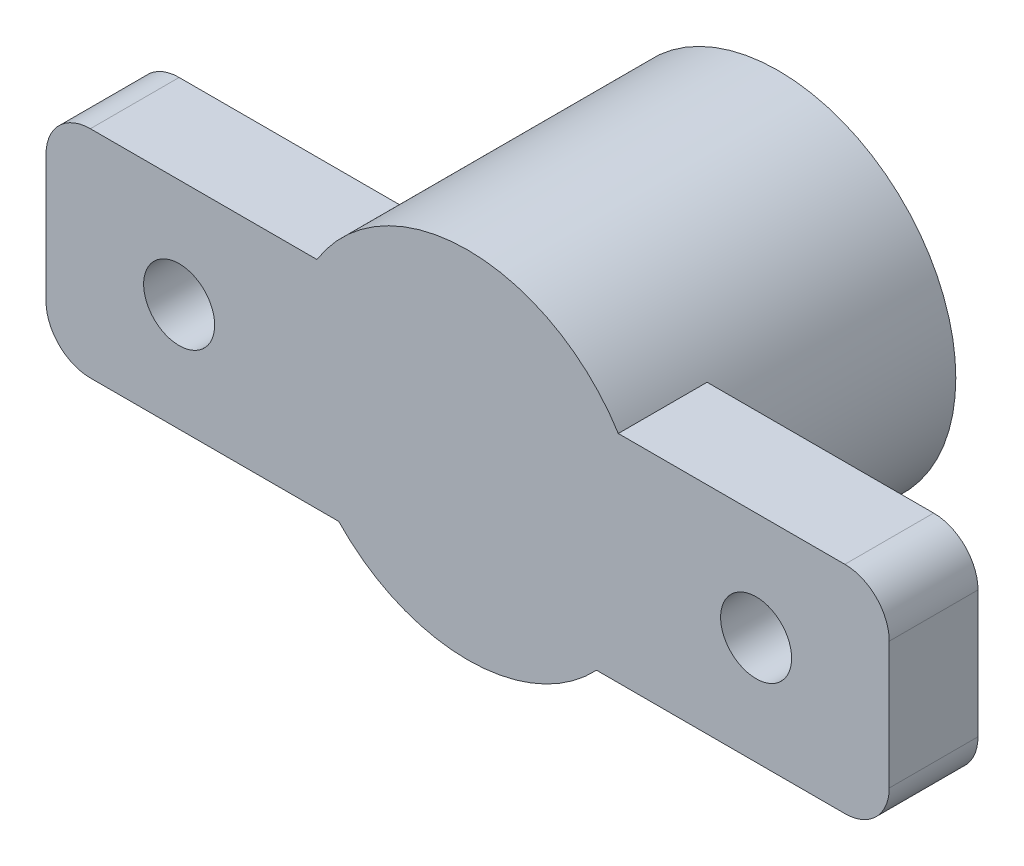
ISO-10303-21;
HEADER;
FILE_DESCRIPTION(('STEP AP214'),'2;1');
FILE_NAME('part.step','',(''),(''),'','','');
FILE_SCHEMA(('AUTOMOTIVE_DESIGN { 1 0 10303 214 1 1 1 1 }'));
ENDSEC;
DATA;
#1=APPLICATION_CONTEXT('core data for automotive mechanical design processes');
#2=APPLICATION_PROTOCOL_DEFINITION('international standard','automotive_design',2000,#1);
#3=PRODUCT_CONTEXT('',#1,'mechanical');
#4=PRODUCT('Part','Part','',(#3));
#5=PRODUCT_RELATED_PRODUCT_CATEGORY('part','',(#4));
#6=PRODUCT_DEFINITION_FORMATION('','',#4);
#7=PRODUCT_DEFINITION_CONTEXT('part definition',#1,'design');
#8=PRODUCT_DEFINITION('design','',#6,#7);
#9=PRODUCT_DEFINITION_SHAPE('','',#8);
#10=(LENGTH_UNIT() NAMED_UNIT(*) SI_UNIT(.MILLI.,.METRE.));
#11=(NAMED_UNIT(*) PLANE_ANGLE_UNIT() SI_UNIT($,.RADIAN.));
#12=(NAMED_UNIT(*) SI_UNIT($,.STERADIAN.) SOLID_ANGLE_UNIT());
#13=UNCERTAINTY_MEASURE_WITH_UNIT(LENGTH_MEASURE(1.E-05),#10,'distance_accuracy_value','');
#14=(GEOMETRIC_REPRESENTATION_CONTEXT(3) GLOBAL_UNCERTAINTY_ASSIGNED_CONTEXT((#13)) GLOBAL_UNIT_ASSIGNED_CONTEXT((#10,
#11,#12)) REPRESENTATION_CONTEXT('',''));
#15=CARTESIAN_POINT('',(0.,0.,0.));
#16=DIRECTION('',(0.,0.,1.));
#17=DIRECTION('',(1.,0.,0.));
#18=AXIS2_PLACEMENT_3D('',#15,#16,#17);
#19=CARTESIAN_POINT('',(0.,0.,0.));
#20=DIRECTION('',(0.,0.,1.));
#21=DIRECTION('',(1.,0.,0.));
#22=AXIS2_PLACEMENT_3D('',#19,#20,#21);
#23=PLANE('',#22);
#24=CARTESIAN_POINT('',(0.,0.,0.));
#25=DIRECTION('',(0.,0.,1.));
#26=DIRECTION('',(1.,0.,0.));
#27=AXIS2_PLACEMENT_3D('',#24,#25,#26);
#28=CIRCLE('',#27,8.);
#29=CARTESIAN_POINT('',(8.,0.,0.));
#30=VERTEX_POINT('',#29);
#31=EDGE_CURVE('E213',#30,#30,#28,.T.);
#32=ORIENTED_EDGE('',*,*,#31,.F.);
#33=EDGE_LOOP('',(#32));
#34=FACE_BOUND('',#33,.T.);
#35=CARTESIAN_POINT('',(0.,0.,0.));
#36=DIRECTION('',(0.,0.,1.));
#37=DIRECTION('',(1.,0.,0.));
#38=AXIS2_PLACEMENT_3D('',#35,#36,#37);
#39=CIRCLE('',#38,2.6);
#40=CARTESIAN_POINT('',(-1.6,-2.04939015319192,0.));
#41=VERTEX_POINT('',#40);
#42=CARTESIAN_POINT('',(-1.6,2.04939015319192,0.));
#43=VERTEX_POINT('',#42);
#44=EDGE_CURVE('E154',#41,#43,#39,.T.);
#45=ORIENTED_EDGE('',*,*,#44,.T.);
#46=DIRECTION('',(0.,-1.,0.));
#47=VECTOR('',#46,1.);
#48=CARTESIAN_POINT('',(-1.6,2.04939015319192,0.));
#49=LINE('',#48,#47);
#50=EDGE_CURVE('E200',#43,#41,#49,.T.);
#51=ORIENTED_EDGE('',*,*,#50,.T.);
#52=EDGE_LOOP('',(#45,#51));
#53=FACE_BOUND('',#52,.T.);
#54=ADVANCED_FACE('F33',(#34,#53),#23,.F.);
#55=CARTESIAN_POINT('',(0.,0.,10.));
#56=DIRECTION('',(0.,0.,-1.));
#57=DIRECTION('',(-1.,0.,0.));
#58=AXIS2_PLACEMENT_3D('',#55,#56,#57);
#59=CYLINDRICAL_SURFACE('',#58,8.);
#60=CARTESIAN_POINT('',(0.,0.,10.));
#61=DIRECTION('',(0.,0.,1.));
#62=DIRECTION('',(1.,0.,0.));
#63=AXIS2_PLACEMENT_3D('',#60,#61,#62);
#64=CIRCLE('',#63,8.);
#65=CARTESIAN_POINT('',(-6.79022090951392,4.23,10.));
#66=VERTEX_POINT('',#65);
#67=CARTESIAN_POINT('',(-5.80947501931113,-5.5,10.));
#68=VERTEX_POINT('',#67);
#69=EDGE_CURVE('E217',#66,#68,#64,.T.);
#70=ORIENTED_EDGE('',*,*,#69,.F.);
#71=DIRECTION('',(0.,0.,-1.));
#72=VECTOR('',#71,1.);
#73=CARTESIAN_POINT('',(-6.79022090951392,4.23,14.));
#74=LINE('',#73,#72);
#75=CARTESIAN_POINT('',(-6.79022090951392,4.23,14.));
#76=VERTEX_POINT('',#75);
#77=EDGE_CURVE('E175',#76,#66,#74,.T.);
#78=ORIENTED_EDGE('',*,*,#77,.F.);
#79=CARTESIAN_POINT('',(0.,0.,14.));
#80=DIRECTION('',(0.,0.,1.));
#81=DIRECTION('',(1.,0.,0.));
#82=AXIS2_PLACEMENT_3D('',#79,#80,#81);
#83=CIRCLE('',#82,8.);
#84=CARTESIAN_POINT('',(6.79022090951392,4.23,14.));
#85=VERTEX_POINT('',#84);
#86=EDGE_CURVE('E170',#85,#76,#83,.T.);
#87=ORIENTED_EDGE('',*,*,#86,.F.);
#88=DIRECTION('',(0.,0.,-1.));
#89=VECTOR('',#88,1.);
#90=CARTESIAN_POINT('',(6.79022090951392,4.23,14.));
#91=LINE('',#90,#89);
#92=CARTESIAN_POINT('',(6.79022090951392,4.23,10.));
#93=VERTEX_POINT('',#92);
#94=EDGE_CURVE('E192',#85,#93,#91,.T.);
#95=ORIENTED_EDGE('',*,*,#94,.T.);
#96=CARTESIAN_POINT('',(5.80947501931113,-5.5,10.));
#97=VERTEX_POINT('',#96);
#98=EDGE_CURVE('E214',#97,#93,#64,.T.);
#99=ORIENTED_EDGE('',*,*,#98,.F.);
#100=DIRECTION('',(0.,0.,-1.));
#101=VECTOR('',#100,1.);
#102=CARTESIAN_POINT('',(5.80947501931113,-5.5,14.));
#103=LINE('',#102,#101);
#104=CARTESIAN_POINT('',(5.80947501931113,-5.5,14.));
#105=VERTEX_POINT('',#104);
#106=EDGE_CURVE('E155',#105,#97,#103,.T.);
#107=ORIENTED_EDGE('',*,*,#106,.F.);
#108=CARTESIAN_POINT('',(0.,0.,14.));
#109=DIRECTION('',(0.,0.,1.));
#110=DIRECTION('',(1.,0.,0.));
#111=AXIS2_PLACEMENT_3D('',#108,#109,#110);
#112=CIRCLE('',#111,8.);
#113=CARTESIAN_POINT('',(-5.80947501931113,-5.5,14.));
#114=VERTEX_POINT('',#113);
#115=EDGE_CURVE('E138',#114,#105,#112,.T.);
#116=ORIENTED_EDGE('',*,*,#115,.F.);
#117=DIRECTION('',(0.,0.,-1.));
#118=VECTOR('',#117,1.);
#119=CARTESIAN_POINT('',(-5.80947501931113,-5.5,14.));
#120=LINE('',#119,#118);
#121=EDGE_CURVE('E148',#114,#68,#120,.T.);
#122=ORIENTED_EDGE('',*,*,#121,.T.);
#123=EDGE_LOOP('',(#70,#78,#87,#95,#99,#107,#116,#122));
#124=FACE_BOUND('',#123,.T.);
#125=ORIENTED_EDGE('',*,*,#31,.T.);
#126=EDGE_LOOP('',(#125));
#127=FACE_BOUND('',#126,.T.);
#128=ADVANCED_FACE('F157',(#124,#127),#59,.T.);
#129=CARTESIAN_POINT('',(0.,0.,10.));
#130=DIRECTION('',(0.,0.,-1.));
#131=DIRECTION('',(-1.,0.,0.));
#132=AXIS2_PLACEMENT_3D('',#129,#130,#131);
#133=CYLINDRICAL_SURFACE('',#132,2.6);
#134=ORIENTED_EDGE('',*,*,#44,.F.);
#135=DIRECTION('',(0.,0.,-1.));
#136=VECTOR('',#135,1.);
#137=CARTESIAN_POINT('',(-1.6,-2.04939015319192,10.));
#138=LINE('',#137,#136);
#139=CARTESIAN_POINT('',(-1.6,-2.04939015319192,10.));
#140=VERTEX_POINT('',#139);
#141=EDGE_CURVE('E203',#140,#41,#138,.T.);
#142=ORIENTED_EDGE('',*,*,#141,.F.);
#143=CARTESIAN_POINT('',(0.,0.,10.));
#144=DIRECTION('',(0.,0.,1.));
#145=DIRECTION('',(1.,0.,0.));
#146=AXIS2_PLACEMENT_3D('',#143,#144,#145);
#147=CIRCLE('',#146,2.6);
#148=CARTESIAN_POINT('',(-1.6,2.04939015319192,10.));
#149=VERTEX_POINT('',#148);
#150=EDGE_CURVE('E196',#140,#149,#147,.T.);
#151=ORIENTED_EDGE('',*,*,#150,.T.);
#152=DIRECTION('',(0.,0.,-1.));
#153=VECTOR('',#152,1.);
#154=CARTESIAN_POINT('',(-1.6,2.04939015319192,10.));
#155=LINE('',#154,#153);
#156=EDGE_CURVE('E210',#149,#43,#155,.T.);
#157=ORIENTED_EDGE('',*,*,#156,.T.);
#158=EDGE_LOOP('',(#134,#142,#151,#157));
#159=FACE_BOUND('',#158,.T.);
#160=ADVANCED_FACE('F275',(#159),#133,.F.);
#161=CARTESIAN_POINT('',(-1.6,2.04939015319192,10.));
#162=DIRECTION('',(1.,0.,0.));
#163=DIRECTION('',(0.,0.,-1.));
#164=AXIS2_PLACEMENT_3D('',#161,#162,#163);
#165=PLANE('',#164);
#166=ORIENTED_EDGE('',*,*,#50,.F.);
#167=ORIENTED_EDGE('',*,*,#156,.F.);
#168=DIRECTION('',(0.,-1.,0.));
#169=VECTOR('',#168,1.);
#170=CARTESIAN_POINT('',(-1.6,2.04939015319192,10.));
#171=LINE('',#170,#169);
#172=EDGE_CURVE('E199',#149,#140,#171,.T.);
#173=ORIENTED_EDGE('',*,*,#172,.T.);
#174=ORIENTED_EDGE('',*,*,#141,.T.);
#175=EDGE_LOOP('',(#166,#167,#173,#174));
#176=FACE_BOUND('',#175,.T.);
#177=ADVANCED_FACE('F282',(#176),#165,.T.);
#178=CARTESIAN_POINT('',(0.,0.,10.));
#179=DIRECTION('',(0.,0.,1.));
#180=DIRECTION('',(1.,0.,0.));
#181=AXIS2_PLACEMENT_3D('',#178,#179,#180);
#182=PLANE('',#181);
#183=ORIENTED_EDGE('',*,*,#172,.F.);
#184=ORIENTED_EDGE('',*,*,#150,.F.);
#185=EDGE_LOOP('',(#183,#184));
#186=FACE_BOUND('',#185,.T.);
#187=ADVANCED_FACE('F286',(#186),#182,.F.);
#188=CARTESIAN_POINT('',(-13.,-0.634999999999999,10.));
#189=DIRECTION('',(0.,0.,1.));
#190=DIRECTION('',(1.,0.,0.));
#191=AXIS2_PLACEMENT_3D('',#188,#189,#190);
#192=CIRCLE('',#191,1.6);
#193=CARTESIAN_POINT('',(-11.4,-0.634999999999999,10.));
#194=VERTEX_POINT('',#193);
#195=EDGE_CURVE('E178',#194,#194,#192,.T.);
#196=ORIENTED_EDGE('',*,*,#195,.T.);
#197=EDGE_LOOP('',(#196));
#198=FACE_BOUND('',#197,.T.);
#199=DIRECTION('',(0.,-1.,0.));
#200=VECTOR('',#199,1.);
#201=CARTESIAN_POINT('',(-19.,-5.5,10.));
#202=LINE('',#201,#200);
#203=CARTESIAN_POINT('',(-19.,2.23,10.));
#204=VERTEX_POINT('',#203);
#205=CARTESIAN_POINT('',(-19.,-3.5,10.));
#206=VERTEX_POINT('',#205);
#207=EDGE_CURVE('E176',#204,#206,#202,.T.);
#208=ORIENTED_EDGE('',*,*,#207,.F.);
#209=CARTESIAN_POINT('',(-17.,2.23,10.));
#210=DIRECTION('',(0.,0.,1.));
#211=DIRECTION('',(1.,0.,0.));
#212=AXIS2_PLACEMENT_3D('',#209,#210,#211);
#213=CIRCLE('',#212,2.);
#214=CARTESIAN_POINT('',(-17.,4.23,10.));
#215=VERTEX_POINT('',#214);
#216=EDGE_CURVE('E41',#204,#215,#213,.F.);
#217=ORIENTED_EDGE('',*,*,#216,.T.);
#218=DIRECTION('',(-1.,0.,0.));
#219=VECTOR('',#218,1.);
#220=CARTESIAN_POINT('',(-19.,4.23,10.));
#221=LINE('',#220,#219);
#222=EDGE_CURVE('E188',#66,#215,#221,.T.);
#223=ORIENTED_EDGE('',*,*,#222,.F.);
#224=ORIENTED_EDGE('',*,*,#69,.T.);
#225=DIRECTION('',(1.,0.,0.));
#226=VECTOR('',#225,1.);
#227=CARTESIAN_POINT('',(-5.80947501931113,-5.5,10.));
#228=LINE('',#227,#226);
#229=CARTESIAN_POINT('',(-17.,-5.5,10.));
#230=VERTEX_POINT('',#229);
#231=EDGE_CURVE('E151',#230,#68,#228,.T.);
#232=ORIENTED_EDGE('',*,*,#231,.F.);
#233=CARTESIAN_POINT('',(-17.,-3.5,10.));
#234=DIRECTION('',(0.,0.,1.));
#235=DIRECTION('',(1.,0.,0.));
#236=AXIS2_PLACEMENT_3D('',#233,#234,#235);
#237=CIRCLE('',#236,2.);
#238=EDGE_CURVE('E232',#230,#206,#237,.F.);
#239=ORIENTED_EDGE('',*,*,#238,.T.);
#240=EDGE_LOOP('',(#208,#217,#223,#224,#232,#239));
#241=FACE_BOUND('',#240,.T.);
#242=ADVANCED_FACE('F254',(#198,#241),#182,.F.);
#243=CARTESIAN_POINT('',(13.,-0.634999999999999,10.));
#244=DIRECTION('',(0.,0.,1.));
#245=DIRECTION('',(1.,0.,0.));
#246=AXIS2_PLACEMENT_3D('',#243,#244,#245);
#247=CIRCLE('',#246,1.6);
#248=CARTESIAN_POINT('',(14.6,-0.634999999999999,10.));
#249=VERTEX_POINT('',#248);
#250=EDGE_CURVE('E330',#249,#249,#247,.T.);
#251=ORIENTED_EDGE('',*,*,#250,.T.);
#252=EDGE_LOOP('',(#251));
#253=FACE_BOUND('',#252,.T.);
#254=DIRECTION('',(-1.,0.,0.));
#255=VECTOR('',#254,1.);
#256=CARTESIAN_POINT('',(6.79022090951392,4.23,10.));
#257=LINE('',#256,#255);
#258=CARTESIAN_POINT('',(17.,4.23,10.));
#259=VERTEX_POINT('',#258);
#260=EDGE_CURVE('E186',#259,#93,#257,.T.);
#261=ORIENTED_EDGE('',*,*,#260,.F.);
#262=CARTESIAN_POINT('',(17.,2.23,10.));
#263=DIRECTION('',(0.,0.,1.));
#264=DIRECTION('',(1.,0.,0.));
#265=AXIS2_PLACEMENT_3D('',#262,#263,#264);
#266=CIRCLE('',#265,2.);
#267=CARTESIAN_POINT('',(19.,2.23,10.));
#268=VERTEX_POINT('',#267);
#269=EDGE_CURVE('E241',#259,#268,#266,.F.);
#270=ORIENTED_EDGE('',*,*,#269,.T.);
#271=DIRECTION('',(0.,1.,0.));
#272=VECTOR('',#271,1.);
#273=CARTESIAN_POINT('',(19.,-5.5,10.));
#274=LINE('',#273,#272);
#275=CARTESIAN_POINT('',(19.,-3.5,10.));
#276=VERTEX_POINT('',#275);
#277=EDGE_CURVE('E183',#276,#268,#274,.T.);
#278=ORIENTED_EDGE('',*,*,#277,.F.);
#279=CARTESIAN_POINT('',(17.,-3.5,10.));
#280=DIRECTION('',(0.,0.,1.));
#281=DIRECTION('',(1.,0.,0.));
#282=AXIS2_PLACEMENT_3D('',#279,#280,#281);
#283=CIRCLE('',#282,2.);
#284=CARTESIAN_POINT('',(17.,-5.5,10.));
#285=VERTEX_POINT('',#284);
#286=EDGE_CURVE('E223',#276,#285,#283,.F.);
#287=ORIENTED_EDGE('',*,*,#286,.T.);
#288=DIRECTION('',(1.,0.,0.));
#289=VECTOR('',#288,1.);
#290=CARTESIAN_POINT('',(19.,-5.5,10.));
#291=LINE('',#290,#289);
#292=EDGE_CURVE('E180',#97,#285,#291,.T.);
#293=ORIENTED_EDGE('',*,*,#292,.F.);
#294=ORIENTED_EDGE('',*,*,#98,.T.);
#295=EDGE_LOOP('',(#261,#270,#278,#287,#293,#294));
#296=FACE_BOUND('',#295,.T.);
#297=ADVANCED_FACE('F290',(#253,#296),#182,.F.);
#298=CARTESIAN_POINT('',(-19.,-5.5,14.));
#299=DIRECTION('',(1.,0.,0.));
#300=DIRECTION('',(0.,0.,-1.));
#301=AXIS2_PLACEMENT_3D('',#298,#299,#300);
#302=PLANE('',#301);
#303=DIRECTION('',(0.,-1.,0.));
#304=VECTOR('',#303,1.);
#305=CARTESIAN_POINT('',(-19.,-5.5,14.));
#306=LINE('',#305,#304);
#307=CARTESIAN_POINT('',(-19.,2.23,14.));
#308=VERTEX_POINT('',#307);
#309=CARTESIAN_POINT('',(-19.,-3.5,14.));
#310=VERTEX_POINT('',#309);
#311=EDGE_CURVE('E145',#308,#310,#306,.T.);
#312=ORIENTED_EDGE('',*,*,#311,.F.);
#313=DIRECTION('',(0.,0.,-1.));
#314=VECTOR('',#313,1.);
#315=CARTESIAN_POINT('',(-19.,2.23,14.));
#316=LINE('',#315,#314);
#317=EDGE_CURVE('E249',#308,#204,#316,.T.);
#318=ORIENTED_EDGE('',*,*,#317,.T.);
#319=ORIENTED_EDGE('',*,*,#207,.T.);
#320=DIRECTION('',(0.,0.,-1.));
#321=VECTOR('',#320,1.);
#322=CARTESIAN_POINT('',(-19.,-3.5,14.));
#323=LINE('',#322,#321);
#324=EDGE_CURVE('E235',#206,#310,#323,.F.);
#325=ORIENTED_EDGE('',*,*,#324,.T.);
#326=EDGE_LOOP('',(#312,#318,#319,#325));
#327=FACE_BOUND('',#326,.T.);
#328=ADVANCED_FACE('F252',(#327),#302,.F.);
#329=CARTESIAN_POINT('',(-5.80947501931113,-5.5,14.));
#330=DIRECTION('',(0.,1.,0.));
#331=DIRECTION('',(0.,0.,1.));
#332=AXIS2_PLACEMENT_3D('',#329,#330,#331);
#333=PLANE('',#332);
#334=DIRECTION('',(1.,0.,0.));
#335=VECTOR('',#334,1.);
#336=CARTESIAN_POINT('',(-5.80947501931113,-5.5,14.));
#337=LINE('',#336,#335);
#338=CARTESIAN_POINT('',(-17.,-5.5,14.));
#339=VERTEX_POINT('',#338);
#340=EDGE_CURVE('E132',#339,#114,#337,.T.);
#341=ORIENTED_EDGE('',*,*,#340,.F.);
#342=DIRECTION('',(0.,0.,-1.));
#343=VECTOR('',#342,1.);
#344=CARTESIAN_POINT('',(-17.,-5.5,14.));
#345=LINE('',#344,#343);
#346=EDGE_CURVE('E230',#339,#230,#345,.T.);
#347=ORIENTED_EDGE('',*,*,#346,.T.);
#348=ORIENTED_EDGE('',*,*,#231,.T.);
#349=ORIENTED_EDGE('',*,*,#121,.F.);
#350=EDGE_LOOP('',(#341,#347,#348,#349));
#351=FACE_BOUND('',#350,.T.);
#352=ADVANCED_FACE('F149',(#351),#333,.F.);
#353=CARTESIAN_POINT('',(19.,-5.5,14.));
#354=DIRECTION('',(0.,1.,0.));
#355=DIRECTION('',(0.,0.,1.));
#356=AXIS2_PLACEMENT_3D('',#353,#354,#355);
#357=PLANE('',#356);
#358=ORIENTED_EDGE('',*,*,#292,.T.);
#359=DIRECTION('',(0.,0.,-1.));
#360=VECTOR('',#359,1.);
#361=CARTESIAN_POINT('',(17.,-5.5,14.));
#362=LINE('',#361,#360);
#363=CARTESIAN_POINT('',(17.,-5.5,14.));
#364=VERTEX_POINT('',#363);
#365=EDGE_CURVE('E225',#285,#364,#362,.F.);
#366=ORIENTED_EDGE('',*,*,#365,.T.);
#367=DIRECTION('',(1.,0.,0.));
#368=VECTOR('',#367,1.);
#369=CARTESIAN_POINT('',(19.,-5.5,14.));
#370=LINE('',#369,#368);
#371=EDGE_CURVE('E161',#105,#364,#370,.T.);
#372=ORIENTED_EDGE('',*,*,#371,.F.);
#373=ORIENTED_EDGE('',*,*,#106,.T.);
#374=EDGE_LOOP('',(#358,#366,#372,#373));
#375=FACE_BOUND('',#374,.T.);
#376=ADVANCED_FACE('F293',(#375),#357,.F.);
#377=CARTESIAN_POINT('',(19.,-5.5,14.));
#378=DIRECTION('',(-1.,0.,0.));
#379=DIRECTION('',(0.,0.,1.));
#380=AXIS2_PLACEMENT_3D('',#377,#378,#379);
#381=PLANE('',#380);
#382=ORIENTED_EDGE('',*,*,#277,.T.);
#383=DIRECTION('',(0.,0.,-1.));
#384=VECTOR('',#383,1.);
#385=CARTESIAN_POINT('',(19.,2.23,14.));
#386=LINE('',#385,#384);
#387=CARTESIAN_POINT('',(19.,2.23,14.));
#388=VERTEX_POINT('',#387);
#389=EDGE_CURVE('E243',#268,#388,#386,.F.);
#390=ORIENTED_EDGE('',*,*,#389,.T.);
#391=DIRECTION('',(0.,1.,0.));
#392=VECTOR('',#391,1.);
#393=CARTESIAN_POINT('',(19.,-5.5,14.));
#394=LINE('',#393,#392);
#395=CARTESIAN_POINT('',(19.,-3.5,14.));
#396=VERTEX_POINT('',#395);
#397=EDGE_CURVE('E163',#396,#388,#394,.T.);
#398=ORIENTED_EDGE('',*,*,#397,.F.);
#399=DIRECTION('',(0.,0.,-1.));
#400=VECTOR('',#399,1.);
#401=CARTESIAN_POINT('',(19.,-3.5,14.));
#402=LINE('',#401,#400);
#403=EDGE_CURVE('E220',#396,#276,#402,.T.);
#404=ORIENTED_EDGE('',*,*,#403,.T.);
#405=EDGE_LOOP('',(#382,#390,#398,#404));
#406=FACE_BOUND('',#405,.T.);
#407=ADVANCED_FACE('F296',(#406),#381,.F.);
#408=CARTESIAN_POINT('',(6.79022090951392,4.23,14.));
#409=DIRECTION('',(0.,-1.,0.));
#410=DIRECTION('',(0.,0.,-1.));
#411=AXIS2_PLACEMENT_3D('',#408,#409,#410);
#412=PLANE('',#411);
#413=DIRECTION('',(-1.,0.,0.));
#414=VECTOR('',#413,1.);
#415=CARTESIAN_POINT('',(6.79022090951392,4.23,14.));
#416=LINE('',#415,#414);
#417=CARTESIAN_POINT('',(17.,4.23,14.));
#418=VERTEX_POINT('',#417);
#419=EDGE_CURVE('E168',#418,#85,#416,.T.);
#420=ORIENTED_EDGE('',*,*,#419,.F.);
#421=DIRECTION('',(0.,0.,-1.));
#422=VECTOR('',#421,1.);
#423=CARTESIAN_POINT('',(17.,4.23,14.));
#424=LINE('',#423,#422);
#425=EDGE_CURVE('E238',#418,#259,#424,.T.);
#426=ORIENTED_EDGE('',*,*,#425,.T.);
#427=ORIENTED_EDGE('',*,*,#260,.T.);
#428=ORIENTED_EDGE('',*,*,#94,.F.);
#429=EDGE_LOOP('',(#420,#426,#427,#428));
#430=FACE_BOUND('',#429,.T.);
#431=ADVANCED_FACE('F300',(#430),#412,.F.);
#432=CARTESIAN_POINT('',(-19.,4.23,14.));
#433=DIRECTION('',(0.,-1.,0.));
#434=DIRECTION('',(0.,0.,-1.));
#435=AXIS2_PLACEMENT_3D('',#432,#433,#434);
#436=PLANE('',#435);
#437=ORIENTED_EDGE('',*,*,#222,.T.);
#438=DIRECTION('',(0.,0.,-1.));
#439=VECTOR('',#438,1.);
#440=CARTESIAN_POINT('',(-17.,4.23,14.));
#441=LINE('',#440,#439);
#442=CARTESIAN_POINT('',(-17.,4.23,14.));
#443=VERTEX_POINT('',#442);
#444=EDGE_CURVE('E11',#215,#443,#441,.F.);
#445=ORIENTED_EDGE('',*,*,#444,.T.);
#446=DIRECTION('',(-1.,0.,0.));
#447=VECTOR('',#446,1.);
#448=CARTESIAN_POINT('',(-19.,4.23,14.));
#449=LINE('',#448,#447);
#450=EDGE_CURVE('E172',#76,#443,#449,.T.);
#451=ORIENTED_EDGE('',*,*,#450,.F.);
#452=ORIENTED_EDGE('',*,*,#77,.T.);
#453=EDGE_LOOP('',(#437,#445,#451,#452));
#454=FACE_BOUND('',#453,.T.);
#455=ADVANCED_FACE('F304',(#454),#436,.F.);
#456=CARTESIAN_POINT('',(0.,0.,14.));
#457=DIRECTION('',(0.,0.,1.));
#458=DIRECTION('',(1.,0.,0.));
#459=AXIS2_PLACEMENT_3D('',#456,#457,#458);
#460=PLANE('',#459);
#461=CARTESIAN_POINT('',(13.,-0.634999999999999,14.));
#462=DIRECTION('',(0.,0.,1.));
#463=DIRECTION('',(1.,0.,0.));
#464=AXIS2_PLACEMENT_3D('',#461,#462,#463);
#465=CIRCLE('',#464,1.6);
#466=CARTESIAN_POINT('',(14.6,-0.634999999999999,14.));
#467=VERTEX_POINT('',#466);
#468=EDGE_CURVE('E327',#467,#467,#465,.T.);
#469=ORIENTED_EDGE('',*,*,#468,.F.);
#470=EDGE_LOOP('',(#469));
#471=FACE_BOUND('',#470,.T.);
#472=CARTESIAN_POINT('',(-13.,-0.634999999999999,14.));
#473=DIRECTION('',(0.,0.,1.));
#474=DIRECTION('',(1.,0.,0.));
#475=AXIS2_PLACEMENT_3D('',#472,#473,#474);
#476=CIRCLE('',#475,1.6);
#477=CARTESIAN_POINT('',(-11.4,-0.634999999999999,14.));
#478=VERTEX_POINT('',#477);
#479=EDGE_CURVE('E332',#478,#478,#476,.T.);
#480=ORIENTED_EDGE('',*,*,#479,.F.);
#481=EDGE_LOOP('',(#480));
#482=FACE_BOUND('',#481,.T.);
#483=ORIENTED_EDGE('',*,*,#397,.T.);
#484=CARTESIAN_POINT('',(17.,2.23,14.));
#485=DIRECTION('',(0.,0.,1.));
#486=DIRECTION('',(1.,0.,0.));
#487=AXIS2_PLACEMENT_3D('',#484,#485,#486);
#488=CIRCLE('',#487,2.);
#489=EDGE_CURVE('E247',#388,#418,#488,.T.);
#490=ORIENTED_EDGE('',*,*,#489,.T.);
#491=ORIENTED_EDGE('',*,*,#419,.T.);
#492=ORIENTED_EDGE('',*,*,#86,.T.);
#493=ORIENTED_EDGE('',*,*,#450,.T.);
#494=CARTESIAN_POINT('',(-17.,2.23,14.));
#495=DIRECTION('',(0.,0.,1.));
#496=DIRECTION('',(1.,0.,0.));
#497=AXIS2_PLACEMENT_3D('',#494,#495,#496);
#498=CIRCLE('',#497,2.);
#499=EDGE_CURVE('E245',#443,#308,#498,.T.);
#500=ORIENTED_EDGE('',*,*,#499,.T.);
#501=ORIENTED_EDGE('',*,*,#311,.T.);
#502=CARTESIAN_POINT('',(-17.,-3.5,14.));
#503=DIRECTION('',(0.,0.,1.));
#504=DIRECTION('',(1.,0.,0.));
#505=AXIS2_PLACEMENT_3D('',#502,#503,#504);
#506=CIRCLE('',#505,2.);
#507=EDGE_CURVE('E141',#310,#339,#506,.T.);
#508=ORIENTED_EDGE('',*,*,#507,.T.);
#509=ORIENTED_EDGE('',*,*,#340,.T.);
#510=ORIENTED_EDGE('',*,*,#115,.T.);
#511=ORIENTED_EDGE('',*,*,#371,.T.);
#512=CARTESIAN_POINT('',(17.,-3.5,14.));
#513=DIRECTION('',(0.,0.,1.));
#514=DIRECTION('',(1.,0.,0.));
#515=AXIS2_PLACEMENT_3D('',#512,#513,#514);
#516=CIRCLE('',#515,2.);
#517=EDGE_CURVE('E228',#364,#396,#516,.T.);
#518=ORIENTED_EDGE('',*,*,#517,.T.);
#519=EDGE_LOOP('',(#483,#490,#491,#492,#493,#500,#501,#508,#509,#510,#511,#518));
#520=FACE_BOUND('',#519,.T.);
#521=ADVANCED_FACE('F135',(#471,#482,#520),#460,.T.);
#522=CARTESIAN_POINT('',(17.,-3.5,14.));
#523=DIRECTION('',(0.,0.,-1.));
#524=DIRECTION('',(-1.,0.,0.));
#525=AXIS2_PLACEMENT_3D('',#522,#523,#524);
#526=CYLINDRICAL_SURFACE('',#525,2.);
#527=ORIENTED_EDGE('',*,*,#517,.F.);
#528=ORIENTED_EDGE('',*,*,#365,.F.);
#529=ORIENTED_EDGE('',*,*,#286,.F.);
#530=ORIENTED_EDGE('',*,*,#403,.F.);
#531=EDGE_LOOP('',(#527,#528,#529,#530));
#532=FACE_BOUND('',#531,.T.);
#533=ADVANCED_FACE('F260',(#532),#526,.T.);
#534=CARTESIAN_POINT('',(-17.,-3.5,14.));
#535=DIRECTION('',(0.,0.,-1.));
#536=DIRECTION('',(-1.,0.,0.));
#537=AXIS2_PLACEMENT_3D('',#534,#535,#536);
#538=CYLINDRICAL_SURFACE('',#537,2.);
#539=ORIENTED_EDGE('',*,*,#507,.F.);
#540=ORIENTED_EDGE('',*,*,#324,.F.);
#541=ORIENTED_EDGE('',*,*,#238,.F.);
#542=ORIENTED_EDGE('',*,*,#346,.F.);
#543=EDGE_LOOP('',(#539,#540,#541,#542));
#544=FACE_BOUND('',#543,.T.);
#545=ADVANCED_FACE('F257',(#544),#538,.T.);
#546=CARTESIAN_POINT('',(17.,2.23,14.));
#547=DIRECTION('',(0.,0.,-1.));
#548=DIRECTION('',(-1.,0.,0.));
#549=AXIS2_PLACEMENT_3D('',#546,#547,#548);
#550=CYLINDRICAL_SURFACE('',#549,2.);
#551=ORIENTED_EDGE('',*,*,#489,.F.);
#552=ORIENTED_EDGE('',*,*,#389,.F.);
#553=ORIENTED_EDGE('',*,*,#269,.F.);
#554=ORIENTED_EDGE('',*,*,#425,.F.);
#555=EDGE_LOOP('',(#551,#552,#553,#554));
#556=FACE_BOUND('',#555,.T.);
#557=ADVANCED_FACE('F259',(#556),#550,.T.);
#558=CARTESIAN_POINT('',(-17.,2.23,14.));
#559=DIRECTION('',(0.,0.,-1.));
#560=DIRECTION('',(-1.,0.,0.));
#561=AXIS2_PLACEMENT_3D('',#558,#559,#560);
#562=CYLINDRICAL_SURFACE('',#561,2.);
#563=ORIENTED_EDGE('',*,*,#499,.F.);
#564=ORIENTED_EDGE('',*,*,#444,.F.);
#565=ORIENTED_EDGE('',*,*,#216,.F.);
#566=ORIENTED_EDGE('',*,*,#317,.F.);
#567=EDGE_LOOP('',(#563,#564,#565,#566));
#568=FACE_BOUND('',#567,.T.);
#569=ADVANCED_FACE('F35',(#568),#562,.T.);
#570=CARTESIAN_POINT('',(-13.,-0.634999999999999,4.));
#571=DIRECTION('',(0.,0.,1.));
#572=DIRECTION('',(1.,0.,0.));
#573=AXIS2_PLACEMENT_3D('',#570,#571,#572);
#574=CYLINDRICAL_SURFACE('',#573,1.6);
#575=ORIENTED_EDGE('',*,*,#479,.T.);
#576=EDGE_LOOP('',(#575));
#577=FACE_BOUND('',#576,.T.);
#578=ORIENTED_EDGE('',*,*,#195,.F.);
#579=EDGE_LOOP('',(#578));
#580=FACE_BOUND('',#579,.T.);
#581=ADVANCED_FACE('F315',(#577,#580),#574,.F.);
#582=CARTESIAN_POINT('',(13.,-0.634999999999999,4.));
#583=DIRECTION('',(0.,0.,1.));
#584=DIRECTION('',(1.,0.,0.));
#585=AXIS2_PLACEMENT_3D('',#582,#583,#584);
#586=CYLINDRICAL_SURFACE('',#585,1.6);
#587=ORIENTED_EDGE('',*,*,#468,.T.);
#588=EDGE_LOOP('',(#587));
#589=FACE_BOUND('',#588,.T.);
#590=ORIENTED_EDGE('',*,*,#250,.F.);
#591=EDGE_LOOP('',(#590));
#592=FACE_BOUND('',#591,.T.);
#593=ADVANCED_FACE('F318',(#589,#592),#586,.F.);
#594=CLOSED_SHELL('',(#54,#128,#160,#177,#187,#242,#297,#328,#352,#376,#407,#431,#455,#521,#533,
#545,#557,#569,#581,#593));
#595=MANIFOLD_SOLID_BREP('B2',#594);
#596=ADVANCED_BREP_SHAPE_REPRESENTATION('',(#18,#595),#14);
#597=SHAPE_DEFINITION_REPRESENTATION(#9,#596);
ENDSEC;
END-ISO-10303-21;
